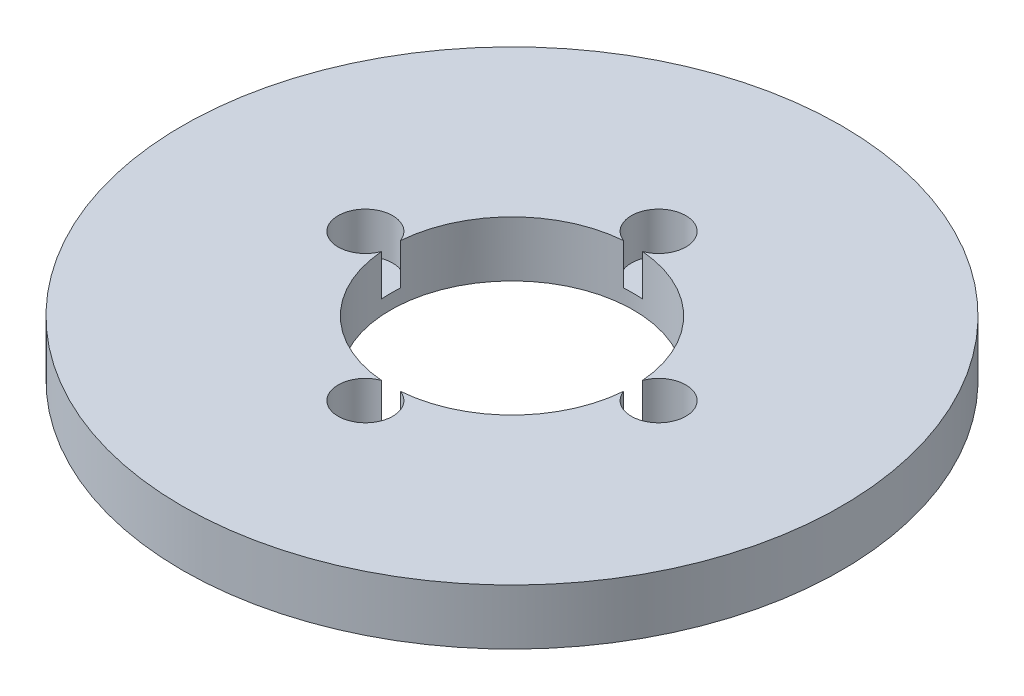
ISO-10303-21;
HEADER;
FILE_DESCRIPTION(('STEP AP214'),'2;1');
FILE_NAME('part.step','',(''),(''),'','','');
FILE_SCHEMA(('AUTOMOTIVE_DESIGN { 1 0 10303 214 1 1 1 1 }'));
ENDSEC;
DATA;
#1=APPLICATION_CONTEXT('core data for automotive mechanical design processes');
#2=APPLICATION_PROTOCOL_DEFINITION('international standard','automotive_design',2000,#1);
#3=PRODUCT_CONTEXT('',#1,'mechanical');
#4=PRODUCT('Part','Part','',(#3));
#5=PRODUCT_RELATED_PRODUCT_CATEGORY('part','',(#4));
#6=PRODUCT_DEFINITION_FORMATION('','',#4);
#7=PRODUCT_DEFINITION_CONTEXT('part definition',#1,'design');
#8=PRODUCT_DEFINITION('design','',#6,#7);
#9=PRODUCT_DEFINITION_SHAPE('','',#8);
#10=(LENGTH_UNIT() NAMED_UNIT(*) SI_UNIT(.MILLI.,.METRE.));
#11=(NAMED_UNIT(*) PLANE_ANGLE_UNIT() SI_UNIT($,.RADIAN.));
#12=(NAMED_UNIT(*) SI_UNIT($,.STERADIAN.) SOLID_ANGLE_UNIT());
#13=UNCERTAINTY_MEASURE_WITH_UNIT(LENGTH_MEASURE(1.E-05),#10,'distance_accuracy_value','');
#14=(GEOMETRIC_REPRESENTATION_CONTEXT(3) GLOBAL_UNCERTAINTY_ASSIGNED_CONTEXT((#13)) GLOBAL_UNIT_ASSIGNED_CONTEXT((#10,
#11,#12)) REPRESENTATION_CONTEXT('',''));
#15=CARTESIAN_POINT('',(0.,0.,0.));
#16=DIRECTION('',(0.,0.,1.));
#17=DIRECTION('',(1.,0.,0.));
#18=AXIS2_PLACEMENT_3D('',#15,#16,#17);
#19=CARTESIAN_POINT('',(0.,16.,0.));
#20=DIRECTION('',(0.,-1.,0.));
#21=DIRECTION('',(0.,0.,-1.));
#22=AXIS2_PLACEMENT_3D('',#19,#20,#21);
#23=CYLINDRICAL_SURFACE('',#22,95.);
#24=CARTESIAN_POINT('',(0.,16.,0.));
#25=DIRECTION('',(0.,1.,0.));
#26=DIRECTION('',(0.,0.,1.));
#27=AXIS2_PLACEMENT_3D('',#24,#25,#26);
#28=CIRCLE('',#27,95.);
#29=CARTESIAN_POINT('',(0.,16.,95.));
#30=VERTEX_POINT('',#29);
#31=EDGE_CURVE('E145',#30,#30,#28,.T.);
#32=ORIENTED_EDGE('',*,*,#31,.F.);
#33=EDGE_LOOP('',(#32));
#34=FACE_BOUND('',#33,.T.);
#35=CARTESIAN_POINT('',(0.,0.,0.));
#36=DIRECTION('',(0.,1.,0.));
#37=DIRECTION('',(0.,0.,1.));
#38=AXIS2_PLACEMENT_3D('',#35,#36,#37);
#39=CIRCLE('',#38,95.);
#40=CARTESIAN_POINT('',(0.,0.,95.));
#41=VERTEX_POINT('',#40);
#42=EDGE_CURVE('E143',#41,#41,#39,.T.);
#43=ORIENTED_EDGE('',*,*,#42,.T.);
#44=EDGE_LOOP('',(#43));
#45=FACE_BOUND('',#44,.T.);
#46=ADVANCED_FACE('F39',(#34,#45),#23,.T.);
#47=CARTESIAN_POINT('',(0.,16.,0.));
#48=DIRECTION('',(0.,1.,0.));
#49=DIRECTION('',(0.,0.,1.));
#50=AXIS2_PLACEMENT_3D('',#47,#48,#49);
#51=PLANE('',#50);
#52=CARTESIAN_POINT('',(1.4754897296131E-13,16.,42.2597054493204));
#53=DIRECTION('',(0.,1.,0.));
#54=DIRECTION('',(1.,0.,0.));
#55=AXIS2_PLACEMENT_3D('',#52,#53,#54);
#56=CIRCLE('',#55,7.85093558288378);
#57=CARTESIAN_POINT('',(-2.71808083186694,16.,34.8942980527111));
#58=VERTEX_POINT('',#57);
#59=CARTESIAN_POINT('',(2.71808083186718,16.,34.8942980527111));
#60=VERTEX_POINT('',#59);
#61=EDGE_CURVE('E152',#58,#60,#56,.T.);
#62=ORIENTED_EDGE('',*,*,#61,.F.);
#63=CARTESIAN_POINT('',(0.,16.,0.));
#64=DIRECTION('',(0.,1.,0.));
#65=DIRECTION('',(0.,0.,1.));
#66=AXIS2_PLACEMENT_3D('',#63,#64,#65);
#67=CIRCLE('',#66,35.);
#68=CARTESIAN_POINT('',(-34.8942980527111,16.,2.71808083186706));
#69=VERTEX_POINT('',#68);
#70=EDGE_CURVE('E133',#69,#58,#67,.T.);
#71=ORIENTED_EDGE('',*,*,#70,.F.);
#72=CARTESIAN_POINT('',(-42.2597054493204,16.,0.));
#73=DIRECTION('',(0.,1.,0.));
#74=DIRECTION('',(0.,0.,1.));
#75=AXIS2_PLACEMENT_3D('',#72,#73,#74);
#76=CIRCLE('',#75,7.85093558288378);
#77=CARTESIAN_POINT('',(-34.8942980527111,16.,-2.71808083186706));
#78=VERTEX_POINT('',#77);
#79=EDGE_CURVE('E128',#78,#69,#76,.T.);
#80=ORIENTED_EDGE('',*,*,#79,.F.);
#81=CARTESIAN_POINT('',(-2.71808083186743,16.,-34.8942980527111));
#82=VERTEX_POINT('',#81);
#83=EDGE_CURVE('E121',#82,#78,#67,.T.);
#84=ORIENTED_EDGE('',*,*,#83,.F.);
#85=CARTESIAN_POINT('',(-4.42646918883929E-13,16.,-42.2597054493204));
#86=DIRECTION('',(0.,1.,0.));
#87=DIRECTION('',(-1.,0.,0.));
#88=AXIS2_PLACEMENT_3D('',#85,#86,#87);
#89=CIRCLE('',#88,7.85093558288378);
#90=CARTESIAN_POINT('',(2.7180808318667,16.,-34.8942980527111));
#91=VERTEX_POINT('',#90);
#92=EDGE_CURVE('E105',#91,#82,#89,.T.);
#93=ORIENTED_EDGE('',*,*,#92,.F.);
#94=CARTESIAN_POINT('',(34.8942980527111,16.,-2.71808083186706));
#95=VERTEX_POINT('',#94);
#96=EDGE_CURVE('E131',#95,#91,#67,.T.);
#97=ORIENTED_EDGE('',*,*,#96,.F.);
#98=CARTESIAN_POINT('',(42.2597054493204,16.,0.));
#99=DIRECTION('',(0.,1.,0.));
#100=DIRECTION('',(0.,0.,-1.));
#101=AXIS2_PLACEMENT_3D('',#98,#99,#100);
#102=CIRCLE('',#101,7.85093558288378);
#103=CARTESIAN_POINT('',(34.8942980527111,16.,2.71808083186706));
#104=VERTEX_POINT('',#103);
#105=EDGE_CURVE('E154',#104,#95,#102,.T.);
#106=ORIENTED_EDGE('',*,*,#105,.F.);
#107=EDGE_CURVE('E134',#60,#104,#67,.T.);
#108=ORIENTED_EDGE('',*,*,#107,.F.);
#109=EDGE_LOOP('',(#62,#71,#80,#84,#93,#97,#106,#108));
#110=FACE_BOUND('',#109,.T.);
#111=ORIENTED_EDGE('',*,*,#31,.T.);
#112=EDGE_LOOP('',(#111));
#113=FACE_BOUND('',#112,.T.);
#114=ADVANCED_FACE('F130',(#110,#113),#51,.T.);
#115=CARTESIAN_POINT('',(0.,0.,0.));
#116=DIRECTION('',(0.,1.,0.));
#117=DIRECTION('',(0.,0.,1.));
#118=AXIS2_PLACEMENT_3D('',#115,#116,#117);
#119=PLANE('',#118);
#120=CARTESIAN_POINT('',(0.,0.,0.));
#121=DIRECTION('',(0.,1.,0.));
#122=DIRECTION('',(0.,0.,1.));
#123=AXIS2_PLACEMENT_3D('',#120,#121,#122);
#124=CIRCLE('',#123,35.);
#125=CARTESIAN_POINT('',(0.,0.,35.));
#126=VERTEX_POINT('',#125);
#127=EDGE_CURVE('E135',#126,#126,#124,.T.);
#128=ORIENTED_EDGE('',*,*,#127,.T.);
#129=EDGE_LOOP('',(#128));
#130=FACE_BOUND('',#129,.T.);
#131=ORIENTED_EDGE('',*,*,#42,.F.);
#132=EDGE_LOOP('',(#131));
#133=FACE_BOUND('',#132,.T.);
#134=ADVANCED_FACE('F195',(#130,#133),#119,.F.);
#135=CARTESIAN_POINT('',(0.,16.,0.));
#136=DIRECTION('',(0.,-1.,0.));
#137=DIRECTION('',(0.,0.,-1.));
#138=AXIS2_PLACEMENT_3D('',#135,#136,#137);
#139=CYLINDRICAL_SURFACE('',#138,35.);
#140=DIRECTION('',(0.,1.,0.));
#141=VECTOR('',#140,1.);
#142=CARTESIAN_POINT('',(-2.71808083186695,10.0770431581538,34.8942980527111));
#143=LINE('',#142,#141);
#144=CARTESIAN_POINT('',(-2.71808083186694,4.15408631630753,34.8942980527111));
#145=VERTEX_POINT('',#144);
#146=EDGE_CURVE('E11',#145,#58,#143,.T.);
#147=ORIENTED_EDGE('',*,*,#146,.F.);
#148=CARTESIAN_POINT('',(0.,4.15408631630753,0.));
#149=DIRECTION('',(0.,1.,0.));
#150=DIRECTION('',(0.,0.,1.));
#151=AXIS2_PLACEMENT_3D('',#148,#149,#150);
#152=CIRCLE('',#151,35.);
#153=CARTESIAN_POINT('',(2.71808083186718,4.15408631630753,34.8942980527111));
#154=VERTEX_POINT('',#153);
#155=EDGE_CURVE('E169',#145,#154,#152,.T.);
#156=ORIENTED_EDGE('',*,*,#155,.T.);
#157=DIRECTION('',(0.,1.,0.));
#158=VECTOR('',#157,1.);
#159=CARTESIAN_POINT('',(2.71808083186719,10.0770431581538,34.8942980527111));
#160=LINE('',#159,#158);
#161=EDGE_CURVE('E46',#60,#154,#160,.F.);
#162=ORIENTED_EDGE('',*,*,#161,.F.);
#163=ORIENTED_EDGE('',*,*,#107,.T.);
#164=DIRECTION('',(0.,1.,0.));
#165=VECTOR('',#164,1.);
#166=CARTESIAN_POINT('',(34.8942980527111,10.0770431581538,2.71808083186707));
#167=LINE('',#166,#165);
#168=CARTESIAN_POINT('',(34.8942980527111,4.15408631630753,2.71808083186706));
#169=VERTEX_POINT('',#168);
#170=EDGE_CURVE('E151',#169,#104,#167,.T.);
#171=ORIENTED_EDGE('',*,*,#170,.F.);
#172=CARTESIAN_POINT('',(0.,4.15408631630753,0.));
#173=DIRECTION('',(0.,1.,0.));
#174=DIRECTION('',(0.,0.,1.));
#175=AXIS2_PLACEMENT_3D('',#172,#173,#174);
#176=CIRCLE('',#175,35.);
#177=CARTESIAN_POINT('',(34.8942980527111,4.15408631630753,-2.71808083186706));
#178=VERTEX_POINT('',#177);
#179=EDGE_CURVE('E173',#169,#178,#176,.T.);
#180=ORIENTED_EDGE('',*,*,#179,.T.);
#181=DIRECTION('',(0.,1.,0.));
#182=VECTOR('',#181,1.);
#183=CARTESIAN_POINT('',(34.8942980527111,10.0770431581538,-2.71808083186707));
#184=LINE('',#183,#182);
#185=EDGE_CURVE('E168',#95,#178,#184,.F.);
#186=ORIENTED_EDGE('',*,*,#185,.F.);
#187=ORIENTED_EDGE('',*,*,#96,.T.);
#188=DIRECTION('',(0.,1.,0.));
#189=VECTOR('',#188,1.);
#190=CARTESIAN_POINT('',(2.7180808318667,10.0770431581538,-34.8942980527111));
#191=LINE('',#190,#189);
#192=CARTESIAN_POINT('',(2.7180808318667,4.15408631630753,-34.8942980527111));
#193=VERTEX_POINT('',#192);
#194=EDGE_CURVE('E108',#193,#91,#191,.T.);
#195=ORIENTED_EDGE('',*,*,#194,.F.);
#196=CARTESIAN_POINT('',(0.,4.15408631630753,0.));
#197=DIRECTION('',(0.,1.,0.));
#198=DIRECTION('',(0.,0.,1.));
#199=AXIS2_PLACEMENT_3D('',#196,#197,#198);
#200=CIRCLE('',#199,35.);
#201=CARTESIAN_POINT('',(-2.71808083186743,4.15408631630753,-34.8942980527111));
#202=VERTEX_POINT('',#201);
#203=EDGE_CURVE('E122',#193,#202,#200,.T.);
#204=ORIENTED_EDGE('',*,*,#203,.T.);
#205=DIRECTION('',(0.,1.,0.));
#206=VECTOR('',#205,1.);
#207=CARTESIAN_POINT('',(-2.71808083186743,10.0770431581538,-34.8942980527111));
#208=LINE('',#207,#206);
#209=EDGE_CURVE('E106',#82,#202,#208,.F.);
#210=ORIENTED_EDGE('',*,*,#209,.F.);
#211=ORIENTED_EDGE('',*,*,#83,.T.);
#212=DIRECTION('',(0.,1.,0.));
#213=VECTOR('',#212,1.);
#214=CARTESIAN_POINT('',(-34.8942980527111,10.0770431581538,-2.71808083186707));
#215=LINE('',#214,#213);
#216=CARTESIAN_POINT('',(-34.8942980527111,4.15408631630753,-2.71808083186706));
#217=VERTEX_POINT('',#216);
#218=EDGE_CURVE('E177',#217,#78,#215,.T.);
#219=ORIENTED_EDGE('',*,*,#218,.F.);
#220=CARTESIAN_POINT('',(0.,4.15408631630753,0.));
#221=DIRECTION('',(0.,1.,0.));
#222=DIRECTION('',(0.,0.,1.));
#223=AXIS2_PLACEMENT_3D('',#220,#221,#222);
#224=CIRCLE('',#223,35.);
#225=CARTESIAN_POINT('',(-34.8942980527111,4.15408631630753,2.71808083186706));
#226=VERTEX_POINT('',#225);
#227=EDGE_CURVE('E185',#217,#226,#224,.T.);
#228=ORIENTED_EDGE('',*,*,#227,.T.);
#229=DIRECTION('',(0.,1.,0.));
#230=VECTOR('',#229,1.);
#231=CARTESIAN_POINT('',(-34.8942980527111,10.0770431581538,2.71808083186707));
#232=LINE('',#231,#230);
#233=EDGE_CURVE('E179',#69,#226,#232,.F.);
#234=ORIENTED_EDGE('',*,*,#233,.F.);
#235=ORIENTED_EDGE('',*,*,#70,.T.);
#236=EDGE_LOOP('',(#147,#156,#162,#163,#171,#180,#186,#187,#195,#204,#210,#211,#219,#228,#234,#235));
#237=FACE_BOUND('',#236,.T.);
#238=ORIENTED_EDGE('',*,*,#127,.F.);
#239=EDGE_LOOP('',(#238));
#240=FACE_BOUND('',#239,.T.);
#241=ADVANCED_FACE('F117',(#237,#240),#139,.F.);
#242=CARTESIAN_POINT('',(-42.2597054493204,4.15408631630753,0.));
#243=DIRECTION('',(0.,1.,0.));
#244=DIRECTION('',(0.,0.,1.));
#245=AXIS2_PLACEMENT_3D('',#242,#243,#244);
#246=CYLINDRICAL_SURFACE('',#245,7.85093558288378);
#247=ORIENTED_EDGE('',*,*,#218,.T.);
#248=ORIENTED_EDGE('',*,*,#79,.T.);
#249=ORIENTED_EDGE('',*,*,#233,.T.);
#250=CARTESIAN_POINT('',(-42.2597054493204,4.15408631630753,0.));
#251=DIRECTION('',(0.,1.,0.));
#252=DIRECTION('',(0.,0.,1.));
#253=AXIS2_PLACEMENT_3D('',#250,#251,#252);
#254=CIRCLE('',#253,7.85093558288378);
#255=EDGE_CURVE('E140',#217,#226,#254,.T.);
#256=ORIENTED_EDGE('',*,*,#255,.F.);
#257=EDGE_LOOP('',(#247,#248,#249,#256));
#258=FACE_BOUND('',#257,.T.);
#259=ADVANCED_FACE('F200',(#258),#246,.F.);
#260=CARTESIAN_POINT('',(-42.2597054493204,4.15408631630753,0.));
#261=DIRECTION('',(0.,1.,0.));
#262=DIRECTION('',(0.,0.,1.));
#263=AXIS2_PLACEMENT_3D('',#260,#261,#262);
#264=PLANE('',#263);
#265=ORIENTED_EDGE('',*,*,#255,.T.);
#266=ORIENTED_EDGE('',*,*,#227,.F.);
#267=EDGE_LOOP('',(#265,#266));
#268=FACE_BOUND('',#267,.T.);
#269=ADVANCED_FACE('F202',(#268),#264,.T.);
#270=CARTESIAN_POINT('',(-4.42646918883929E-13,4.15408631630753,-42.2597054493204));
#271=DIRECTION('',(0.,1.,0.));
#272=DIRECTION('',(0.,0.,1.));
#273=AXIS2_PLACEMENT_3D('',#270,#271,#272);
#274=CYLINDRICAL_SURFACE('',#273,7.85093558288378);
#275=ORIENTED_EDGE('',*,*,#194,.T.);
#276=ORIENTED_EDGE('',*,*,#92,.T.);
#277=ORIENTED_EDGE('',*,*,#209,.T.);
#278=CARTESIAN_POINT('',(-4.42646918883929E-13,4.15408631630753,-42.2597054493204));
#279=DIRECTION('',(0.,1.,0.));
#280=DIRECTION('',(-1.,0.,0.));
#281=AXIS2_PLACEMENT_3D('',#278,#279,#280);
#282=CIRCLE('',#281,7.85093558288378);
#283=EDGE_CURVE('E111',#193,#202,#282,.T.);
#284=ORIENTED_EDGE('',*,*,#283,.F.);
#285=EDGE_LOOP('',(#275,#276,#277,#284));
#286=FACE_BOUND('',#285,.T.);
#287=ADVANCED_FACE('F102',(#286),#274,.F.);
#288=CARTESIAN_POINT('',(-4.42646918883929E-13,4.15408631630753,-42.2597054493204));
#289=DIRECTION('',(0.,1.,0.));
#290=DIRECTION('',(-1.,0.,0.));
#291=AXIS2_PLACEMENT_3D('',#288,#289,#290);
#292=PLANE('',#291);
#293=ORIENTED_EDGE('',*,*,#283,.T.);
#294=ORIENTED_EDGE('',*,*,#203,.F.);
#295=EDGE_LOOP('',(#293,#294));
#296=FACE_BOUND('',#295,.T.);
#297=ADVANCED_FACE('F211',(#296),#292,.T.);
#298=CARTESIAN_POINT('',(42.2597054493204,4.15408631630753,0.));
#299=DIRECTION('',(0.,1.,0.));
#300=DIRECTION('',(0.,0.,1.));
#301=AXIS2_PLACEMENT_3D('',#298,#299,#300);
#302=CYLINDRICAL_SURFACE('',#301,7.85093558288378);
#303=ORIENTED_EDGE('',*,*,#170,.T.);
#304=ORIENTED_EDGE('',*,*,#105,.T.);
#305=ORIENTED_EDGE('',*,*,#185,.T.);
#306=CARTESIAN_POINT('',(42.2597054493204,4.15408631630753,0.));
#307=DIRECTION('',(0.,1.,0.));
#308=DIRECTION('',(0.,0.,-1.));
#309=AXIS2_PLACEMENT_3D('',#306,#307,#308);
#310=CIRCLE('',#309,7.85093558288378);
#311=EDGE_CURVE('E56',#169,#178,#310,.T.);
#312=ORIENTED_EDGE('',*,*,#311,.F.);
#313=EDGE_LOOP('',(#303,#304,#305,#312));
#314=FACE_BOUND('',#313,.T.);
#315=ADVANCED_FACE('F212',(#314),#302,.F.);
#316=CARTESIAN_POINT('',(42.2597054493204,4.15408631630753,0.));
#317=DIRECTION('',(0.,1.,0.));
#318=DIRECTION('',(0.,0.,-1.));
#319=AXIS2_PLACEMENT_3D('',#316,#317,#318);
#320=PLANE('',#319);
#321=ORIENTED_EDGE('',*,*,#311,.T.);
#322=ORIENTED_EDGE('',*,*,#179,.F.);
#323=EDGE_LOOP('',(#321,#322));
#324=FACE_BOUND('',#323,.T.);
#325=ADVANCED_FACE('F217',(#324),#320,.T.);
#326=CARTESIAN_POINT('',(1.4754897296131E-13,4.15408631630753,42.2597054493204));
#327=DIRECTION('',(0.,1.,0.));
#328=DIRECTION('',(0.,0.,1.));
#329=AXIS2_PLACEMENT_3D('',#326,#327,#328);
#330=CYLINDRICAL_SURFACE('',#329,7.85093558288378);
#331=ORIENTED_EDGE('',*,*,#146,.T.);
#332=ORIENTED_EDGE('',*,*,#61,.T.);
#333=ORIENTED_EDGE('',*,*,#161,.T.);
#334=CARTESIAN_POINT('',(1.4754897296131E-13,4.15408631630753,42.2597054493204));
#335=DIRECTION('',(0.,1.,0.));
#336=DIRECTION('',(1.,0.,0.));
#337=AXIS2_PLACEMENT_3D('',#334,#335,#336);
#338=CIRCLE('',#337,7.85093558288378);
#339=EDGE_CURVE('E55',#145,#154,#338,.T.);
#340=ORIENTED_EDGE('',*,*,#339,.F.);
#341=EDGE_LOOP('',(#331,#332,#333,#340));
#342=FACE_BOUND('',#341,.T.);
#343=ADVANCED_FACE('F170',(#342),#330,.F.);
#344=CARTESIAN_POINT('',(1.4754897296131E-13,4.15408631630753,42.2597054493204));
#345=DIRECTION('',(0.,1.,0.));
#346=DIRECTION('',(1.,0.,0.));
#347=AXIS2_PLACEMENT_3D('',#344,#345,#346);
#348=PLANE('',#347);
#349=ORIENTED_EDGE('',*,*,#339,.T.);
#350=ORIENTED_EDGE('',*,*,#155,.F.);
#351=EDGE_LOOP('',(#349,#350));
#352=FACE_BOUND('',#351,.T.);
#353=ADVANCED_FACE('F224',(#352),#348,.T.);
#354=CLOSED_SHELL('',(#46,#114,#134,#241,#259,#269,#287,#297,#315,#325,#343,#353));
#355=MANIFOLD_SOLID_BREP('B2',#354);
#356=ADVANCED_BREP_SHAPE_REPRESENTATION('',(#18,#355),#14);
#357=SHAPE_DEFINITION_REPRESENTATION(#9,#356);
ENDSEC;
END-ISO-10303-21;
